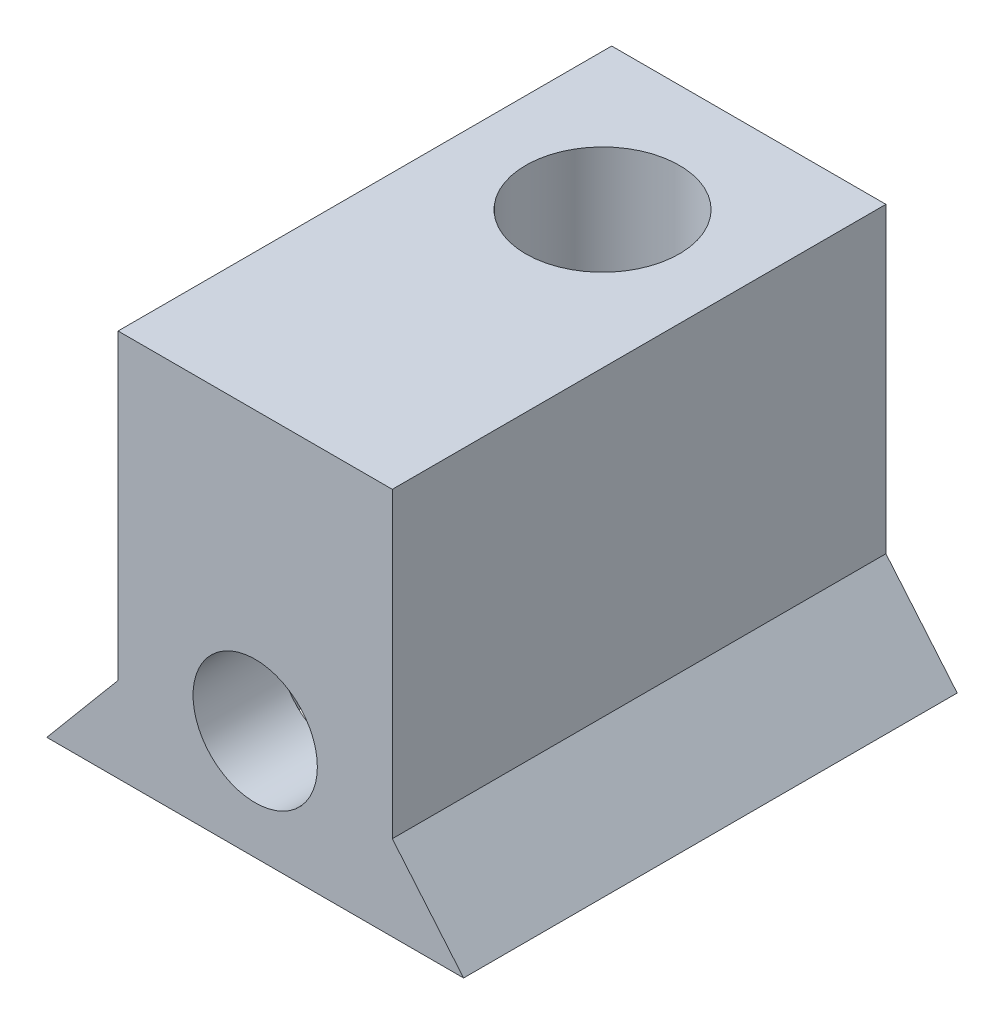
ISO-10303-21;
HEADER;
FILE_DESCRIPTION(('STEP AP214'),'2;1');
FILE_NAME('part.step','',(''),(''),'','','');
FILE_SCHEMA(('AUTOMOTIVE_DESIGN { 1 0 10303 214 1 1 1 1 }'));
ENDSEC;
DATA;
#1=APPLICATION_CONTEXT('core data for automotive mechanical design processes');
#2=APPLICATION_PROTOCOL_DEFINITION('international standard','automotive_design',2000,#1);
#3=PRODUCT_CONTEXT('',#1,'mechanical');
#4=PRODUCT('Part','Part','',(#3));
#5=PRODUCT_RELATED_PRODUCT_CATEGORY('part','',(#4));
#6=PRODUCT_DEFINITION_FORMATION('','',#4);
#7=PRODUCT_DEFINITION_CONTEXT('part definition',#1,'design');
#8=PRODUCT_DEFINITION('design','',#6,#7);
#9=PRODUCT_DEFINITION_SHAPE('','',#8);
#10=(LENGTH_UNIT() NAMED_UNIT(*) SI_UNIT(.MILLI.,.METRE.));
#11=(NAMED_UNIT(*) PLANE_ANGLE_UNIT() SI_UNIT($,.RADIAN.));
#12=(NAMED_UNIT(*) SI_UNIT($,.STERADIAN.) SOLID_ANGLE_UNIT());
#13=UNCERTAINTY_MEASURE_WITH_UNIT(LENGTH_MEASURE(1.E-05),#10,'distance_accuracy_value','');
#14=(GEOMETRIC_REPRESENTATION_CONTEXT(3) GLOBAL_UNCERTAINTY_ASSIGNED_CONTEXT((#13)) GLOBAL_UNIT_ASSIGNED_CONTEXT((#10,
#11,#12)) REPRESENTATION_CONTEXT('',''));
#15=CARTESIAN_POINT('',(0.,0.,0.));
#16=DIRECTION('',(0.,0.,1.));
#17=DIRECTION('',(1.,0.,0.));
#18=AXIS2_PLACEMENT_3D('',#15,#16,#17);
#19=CARTESIAN_POINT('',(0.,3.,13.5));
#20=DIRECTION('',(0.,0.,-1.));
#21=DIRECTION('',(-1.,0.,0.));
#22=AXIS2_PLACEMENT_3D('',#19,#20,#21);
#23=CYLINDRICAL_SURFACE('',#22,1.7);
#24=CARTESIAN_POINT('',(0.,3.,0.));
#25=DIRECTION('',(0.,0.,1.));
#26=DIRECTION('',(1.,0.,0.));
#27=AXIS2_PLACEMENT_3D('',#24,#25,#26);
#28=CIRCLE('',#27,1.7);
#29=CARTESIAN_POINT('',(1.7,3.,0.));
#30=VERTEX_POINT('',#29);
#31=EDGE_CURVE('E229',#30,#30,#28,.T.);
#32=ORIENTED_EDGE('',*,*,#31,.F.);
#33=EDGE_LOOP('',(#32));
#34=FACE_BOUND('',#33,.T.);
#35=CARTESIAN_POINT('',(0.,3.,8.15));
#36=DIRECTION('',(0.,0.,1.));
#37=DIRECTION('',(1.,0.,0.));
#38=AXIS2_PLACEMENT_3D('',#35,#36,#37);
#39=CIRCLE('',#38,1.7);
#40=CARTESIAN_POINT('',(1.7,3.,8.15));
#41=VERTEX_POINT('',#40);
#42=EDGE_CURVE('E173',#41,#41,#39,.T.);
#43=ORIENTED_EDGE('',*,*,#42,.T.);
#44=EDGE_LOOP('',(#43));
#45=FACE_BOUND('',#44,.T.);
#46=ADVANCED_FACE('F39',(#34,#45),#23,.F.);
#47=CARTESIAN_POINT('',(0.,0.,13.5));
#48=DIRECTION('',(0.,0.,-1.));
#49=DIRECTION('',(-1.,0.,0.));
#50=AXIS2_PLACEMENT_3D('',#47,#48,#49);
#51=PLANE('',#50);
#52=DIRECTION('',(-0.642787609686543,0.766044443118974,0.));
#53=VECTOR('',#52,1.);
#54=CARTESIAN_POINT('',(5.7,0.,13.5));
#55=LINE('',#54,#53);
#56=CARTESIAN_POINT('',(5.7,0.,13.5));
#57=VERTEX_POINT('',#56);
#58=CARTESIAN_POINT('',(3.75,2.32391950555868,13.5));
#59=VERTEX_POINT('',#58);
#60=EDGE_CURVE('E159',#57,#59,#55,.T.);
#61=ORIENTED_EDGE('',*,*,#60,.T.);
#62=DIRECTION('',(0.,1.,0.));
#63=VECTOR('',#62,1.);
#64=CARTESIAN_POINT('',(3.75,2.32391950555868,13.5));
#65=LINE('',#64,#63);
#66=CARTESIAN_POINT('',(3.75,10.6,13.5));
#67=VERTEX_POINT('',#66);
#68=EDGE_CURVE('E99',#59,#67,#65,.T.);
#69=ORIENTED_EDGE('',*,*,#68,.T.);
#70=DIRECTION('',(-1.,0.,0.));
#71=VECTOR('',#70,1.);
#72=CARTESIAN_POINT('',(3.75,10.6,13.5));
#73=LINE('',#72,#71);
#74=CARTESIAN_POINT('',(-3.75000000000002,10.6,13.5));
#75=VERTEX_POINT('',#74);
#76=EDGE_CURVE('E116',#67,#75,#73,.T.);
#77=ORIENTED_EDGE('',*,*,#76,.T.);
#78=DIRECTION('',(0.,-1.,0.));
#79=VECTOR('',#78,1.);
#80=CARTESIAN_POINT('',(-3.75000000000002,2.32391950555868,13.5));
#81=LINE('',#80,#79);
#82=CARTESIAN_POINT('',(-3.75000000000002,2.32391950555868,13.5));
#83=VERTEX_POINT('',#82);
#84=EDGE_CURVE('E108',#75,#83,#81,.T.);
#85=ORIENTED_EDGE('',*,*,#84,.T.);
#86=DIRECTION('',(-0.642787609686544,-0.766044443118974,0.));
#87=VECTOR('',#86,1.);
#88=CARTESIAN_POINT('',(-5.70000000000002,0.,13.5));
#89=LINE('',#88,#87);
#90=CARTESIAN_POINT('',(-5.70000000000002,0.,13.5));
#91=VERTEX_POINT('',#90);
#92=EDGE_CURVE('E113',#83,#91,#89,.T.);
#93=ORIENTED_EDGE('',*,*,#92,.T.);
#94=DIRECTION('',(1.,0.,0.));
#95=VECTOR('',#94,1.);
#96=CARTESIAN_POINT('',(-5.70000000000002,0.,13.5));
#97=LINE('',#96,#95);
#98=EDGE_CURVE('E63',#91,#57,#97,.T.);
#99=ORIENTED_EDGE('',*,*,#98,.T.);
#100=EDGE_LOOP('',(#61,#69,#77,#85,#93,#99));
#101=FACE_BOUND('',#100,.T.);
#102=CARTESIAN_POINT('',(0.,3.,13.5));
#103=DIRECTION('',(0.,0.,1.));
#104=DIRECTION('',(1.,0.,0.));
#105=AXIS2_PLACEMENT_3D('',#102,#103,#104);
#106=CIRCLE('',#105,1.7);
#107=CARTESIAN_POINT('',(1.7,3.,13.5));
#108=VERTEX_POINT('',#107);
#109=EDGE_CURVE('E146',#108,#108,#106,.T.);
#110=ORIENTED_EDGE('',*,*,#109,.F.);
#111=EDGE_LOOP('',(#110));
#112=FACE_BOUND('',#111,.T.);
#113=ADVANCED_FACE('F110',(#101,#112),#51,.F.);
#114=CARTESIAN_POINT('',(0.,0.,0.));
#115=DIRECTION('',(0.,0.,-1.));
#116=DIRECTION('',(-1.,0.,0.));
#117=AXIS2_PLACEMENT_3D('',#114,#115,#116);
#118=PLANE('',#117);
#119=DIRECTION('',(-0.642787609686543,0.766044443118974,0.));
#120=VECTOR('',#119,1.);
#121=CARTESIAN_POINT('',(5.7,0.,0.));
#122=LINE('',#121,#120);
#123=CARTESIAN_POINT('',(5.7,0.,0.));
#124=VERTEX_POINT('',#123);
#125=CARTESIAN_POINT('',(3.75,2.32391950555868,0.));
#126=VERTEX_POINT('',#125);
#127=EDGE_CURVE('E141',#124,#126,#122,.T.);
#128=ORIENTED_EDGE('',*,*,#127,.F.);
#129=DIRECTION('',(1.,0.,0.));
#130=VECTOR('',#129,1.);
#131=CARTESIAN_POINT('',(-5.70000000000002,0.,0.));
#132=LINE('',#131,#130);
#133=CARTESIAN_POINT('',(-5.70000000000002,0.,0.));
#134=VERTEX_POINT('',#133);
#135=EDGE_CURVE('E90',#134,#124,#132,.T.);
#136=ORIENTED_EDGE('',*,*,#135,.F.);
#137=DIRECTION('',(-0.642787609686544,-0.766044443118974,0.));
#138=VECTOR('',#137,1.);
#139=CARTESIAN_POINT('',(-5.70000000000002,0.,0.));
#140=LINE('',#139,#138);
#141=CARTESIAN_POINT('',(-3.75000000000002,2.32391950555868,0.));
#142=VERTEX_POINT('',#141);
#143=EDGE_CURVE('E154',#142,#134,#140,.T.);
#144=ORIENTED_EDGE('',*,*,#143,.F.);
#145=DIRECTION('',(0.,-1.,0.));
#146=VECTOR('',#145,1.);
#147=CARTESIAN_POINT('',(-3.75000000000002,2.32391950555868,0.));
#148=LINE('',#147,#146);
#149=CARTESIAN_POINT('',(-3.75000000000002,10.6,0.));
#150=VERTEX_POINT('',#149);
#151=EDGE_CURVE('E126',#150,#142,#148,.T.);
#152=ORIENTED_EDGE('',*,*,#151,.F.);
#153=DIRECTION('',(-1.,0.,0.));
#154=VECTOR('',#153,1.);
#155=CARTESIAN_POINT('',(3.75,10.6,0.));
#156=LINE('',#155,#154);
#157=CARTESIAN_POINT('',(3.75,10.6,0.));
#158=VERTEX_POINT('',#157);
#159=EDGE_CURVE('E149',#158,#150,#156,.T.);
#160=ORIENTED_EDGE('',*,*,#159,.F.);
#161=DIRECTION('',(0.,1.,0.));
#162=VECTOR('',#161,1.);
#163=CARTESIAN_POINT('',(3.75,2.32391950555868,0.));
#164=LINE('',#163,#162);
#165=EDGE_CURVE('E145',#126,#158,#164,.T.);
#166=ORIENTED_EDGE('',*,*,#165,.F.);
#167=EDGE_LOOP('',(#128,#136,#144,#152,#160,#166));
#168=FACE_BOUND('',#167,.T.);
#169=ORIENTED_EDGE('',*,*,#31,.T.);
#170=EDGE_LOOP('',(#169));
#171=FACE_BOUND('',#170,.T.);
#172=ADVANCED_FACE('F249',(#168,#171),#118,.T.);
#173=CARTESIAN_POINT('',(5.7,0.,13.5));
#174=DIRECTION('',(-0.766044443118974,-0.642787609686544,0.));
#175=DIRECTION('',(0.642787609686544,-0.766044443118974,0.));
#176=AXIS2_PLACEMENT_3D('',#173,#174,#175);
#177=PLANE('',#176);
#178=ORIENTED_EDGE('',*,*,#127,.T.);
#179=DIRECTION('',(0.,0.,-1.));
#180=VECTOR('',#179,1.);
#181=CARTESIAN_POINT('',(3.75,2.32391950555868,13.5));
#182=LINE('',#181,#180);
#183=EDGE_CURVE('E170',#59,#126,#182,.T.);
#184=ORIENTED_EDGE('',*,*,#183,.F.);
#185=ORIENTED_EDGE('',*,*,#60,.F.);
#186=DIRECTION('',(0.,0.,-1.));
#187=VECTOR('',#186,1.);
#188=CARTESIAN_POINT('',(5.7,0.,13.5));
#189=LINE('',#188,#187);
#190=EDGE_CURVE('E137',#57,#124,#189,.T.);
#191=ORIENTED_EDGE('',*,*,#190,.T.);
#192=EDGE_LOOP('',(#178,#184,#185,#191));
#193=FACE_BOUND('',#192,.T.);
#194=ADVANCED_FACE('F41',(#193),#177,.F.);
#195=CARTESIAN_POINT('',(3.75,2.32391950555868,13.5));
#196=DIRECTION('',(-1.,0.,0.));
#197=DIRECTION('',(0.,0.,1.));
#198=AXIS2_PLACEMENT_3D('',#195,#196,#197);
#199=PLANE('',#198);
#200=ORIENTED_EDGE('',*,*,#165,.T.);
#201=DIRECTION('',(0.,0.,-1.));
#202=VECTOR('',#201,1.);
#203=CARTESIAN_POINT('',(3.75,10.6,13.5));
#204=LINE('',#203,#202);
#205=EDGE_CURVE('E166',#67,#158,#204,.T.);
#206=ORIENTED_EDGE('',*,*,#205,.F.);
#207=ORIENTED_EDGE('',*,*,#68,.F.);
#208=ORIENTED_EDGE('',*,*,#183,.T.);
#209=EDGE_LOOP('',(#200,#206,#207,#208));
#210=FACE_BOUND('',#209,.T.);
#211=ADVANCED_FACE('F243',(#210),#199,.F.);
#212=CARTESIAN_POINT('',(3.75,10.6,13.5));
#213=DIRECTION('',(0.,-1.,0.));
#214=DIRECTION('',(0.,0.,-1.));
#215=AXIS2_PLACEMENT_3D('',#212,#213,#214);
#216=PLANE('',#215);
#217=CARTESIAN_POINT('',(0.,10.6,4.));
#218=DIRECTION('',(0.,1.,0.));
#219=DIRECTION('',(0.,0.,1.));
#220=AXIS2_PLACEMENT_3D('',#217,#218,#219);
#221=CIRCLE('',#220,2.1);
#222=CARTESIAN_POINT('',(0.,10.6,6.1));
#223=VERTEX_POINT('',#222);
#224=EDGE_CURVE('E218',#223,#223,#221,.T.);
#225=ORIENTED_EDGE('',*,*,#224,.F.);
#226=EDGE_LOOP('',(#225));
#227=FACE_BOUND('',#226,.T.);
#228=ORIENTED_EDGE('',*,*,#159,.T.);
#229=DIRECTION('',(0.,0.,-1.));
#230=VECTOR('',#229,1.);
#231=CARTESIAN_POINT('',(-3.75000000000002,10.6,13.5));
#232=LINE('',#231,#230);
#233=EDGE_CURVE('E130',#75,#150,#232,.T.);
#234=ORIENTED_EDGE('',*,*,#233,.F.);
#235=ORIENTED_EDGE('',*,*,#76,.F.);
#236=ORIENTED_EDGE('',*,*,#205,.T.);
#237=EDGE_LOOP('',(#228,#234,#235,#236));
#238=FACE_BOUND('',#237,.T.);
#239=ADVANCED_FACE('F246',(#227,#238),#216,.F.);
#240=CARTESIAN_POINT('',(-3.75000000000002,2.32391950555868,13.5));
#241=DIRECTION('',(1.,0.,0.));
#242=DIRECTION('',(0.,1.,0.));
#243=AXIS2_PLACEMENT_3D('',#240,#241,#242);
#244=PLANE('',#243);
#245=ORIENTED_EDGE('',*,*,#151,.T.);
#246=DIRECTION('',(0.,0.,-1.));
#247=VECTOR('',#246,1.);
#248=CARTESIAN_POINT('',(-3.75000000000002,2.32391950555868,13.5));
#249=LINE('',#248,#247);
#250=EDGE_CURVE('E123',#83,#142,#249,.T.);
#251=ORIENTED_EDGE('',*,*,#250,.F.);
#252=ORIENTED_EDGE('',*,*,#84,.F.);
#253=ORIENTED_EDGE('',*,*,#233,.T.);
#254=EDGE_LOOP('',(#245,#251,#252,#253));
#255=FACE_BOUND('',#254,.T.);
#256=ADVANCED_FACE('F124',(#255),#244,.F.);
#257=CARTESIAN_POINT('',(-5.70000000000002,0.,13.5));
#258=DIRECTION('',(0.766044443118974,-0.642787609686544,0.));
#259=DIRECTION('',(0.642787609686544,0.766044443118974,0.));
#260=AXIS2_PLACEMENT_3D('',#257,#258,#259);
#261=PLANE('',#260);
#262=ORIENTED_EDGE('',*,*,#143,.T.);
#263=DIRECTION('',(0.,0.,-1.));
#264=VECTOR('',#263,1.);
#265=CARTESIAN_POINT('',(-5.70000000000002,0.,13.5));
#266=LINE('',#265,#264);
#267=EDGE_CURVE('E131',#91,#134,#266,.T.);
#268=ORIENTED_EDGE('',*,*,#267,.F.);
#269=ORIENTED_EDGE('',*,*,#92,.F.);
#270=ORIENTED_EDGE('',*,*,#250,.T.);
#271=EDGE_LOOP('',(#262,#268,#269,#270));
#272=FACE_BOUND('',#271,.T.);
#273=ADVANCED_FACE('F133',(#272),#261,.F.);
#274=CARTESIAN_POINT('',(-5.70000000000002,0.,13.5));
#275=DIRECTION('',(0.,1.,0.));
#276=DIRECTION('',(0.,0.,1.));
#277=AXIS2_PLACEMENT_3D('',#274,#275,#276);
#278=PLANE('',#277);
#279=DIRECTION('',(0.,0.,-1.));
#280=VECTOR('',#279,1.);
#281=CARTESIAN_POINT('',(-2.90118510267787,0.,13.5));
#282=LINE('',#281,#280);
#283=CARTESIAN_POINT('',(-2.90118510267787,0.,11.15));
#284=VERTEX_POINT('',#283);
#285=CARTESIAN_POINT('',(-2.90118510267787,0.,8.15));
#286=VERTEX_POINT('',#285);
#287=EDGE_CURVE('E11',#284,#286,#282,.T.);
#288=ORIENTED_EDGE('',*,*,#287,.F.);
#289=DIRECTION('',(1.,0.,0.));
#290=VECTOR('',#289,1.);
#291=CARTESIAN_POINT('',(-5.70000000000002,0.,11.15));
#292=LINE('',#291,#290);
#293=CARTESIAN_POINT('',(2.90118510267787,0.,11.15));
#294=VERTEX_POINT('',#293);
#295=EDGE_CURVE('E182',#284,#294,#292,.T.);
#296=ORIENTED_EDGE('',*,*,#295,.T.);
#297=DIRECTION('',(0.,0.,1.));
#298=VECTOR('',#297,1.);
#299=CARTESIAN_POINT('',(2.90118510267787,0.,13.5));
#300=LINE('',#299,#298);
#301=CARTESIAN_POINT('',(2.90118510267787,0.,8.15));
#302=VERTEX_POINT('',#301);
#303=EDGE_CURVE('E48',#302,#294,#300,.T.);
#304=ORIENTED_EDGE('',*,*,#303,.F.);
#305=DIRECTION('',(1.,0.,0.));
#306=VECTOR('',#305,1.);
#307=CARTESIAN_POINT('',(-5.70000000000002,0.,8.15));
#308=LINE('',#307,#306);
#309=EDGE_CURVE('E177',#286,#302,#308,.T.);
#310=ORIENTED_EDGE('',*,*,#309,.F.);
#311=EDGE_LOOP('',(#288,#296,#304,#310));
#312=FACE_BOUND('',#311,.T.);
#313=ORIENTED_EDGE('',*,*,#135,.T.);
#314=ORIENTED_EDGE('',*,*,#190,.F.);
#315=ORIENTED_EDGE('',*,*,#98,.F.);
#316=ORIENTED_EDGE('',*,*,#267,.T.);
#317=EDGE_LOOP('',(#313,#314,#315,#316));
#318=FACE_BOUND('',#317,.T.);
#319=ADVANCED_FACE('F216',(#312,#318),#278,.F.);
#320=CARTESIAN_POINT('',(0.,3.,11.15));
#321=DIRECTION('',(0.,0.,1.));
#322=DIRECTION('',(1.,0.,0.));
#323=AXIS2_PLACEMENT_3D('',#320,#321,#322);
#324=CIRCLE('',#323,1.7);
#325=CARTESIAN_POINT('',(1.7,3.,11.15));
#326=VERTEX_POINT('',#325);
#327=EDGE_CURVE('E179',#326,#326,#324,.T.);
#328=ORIENTED_EDGE('',*,*,#327,.F.);
#329=EDGE_LOOP('',(#328));
#330=FACE_BOUND('',#329,.T.);
#331=ORIENTED_EDGE('',*,*,#109,.T.);
#332=EDGE_LOOP('',(#331));
#333=FACE_BOUND('',#332,.T.);
#334=ADVANCED_FACE('F261',(#330,#333),#23,.F.);
#335=CARTESIAN_POINT('',(0.,5.5,4.));
#336=DIRECTION('',(0.,1.,0.));
#337=DIRECTION('',(0.,0.,1.));
#338=AXIS2_PLACEMENT_3D('',#335,#336,#337);
#339=CYLINDRICAL_SURFACE('',#338,2.1);
#340=CARTESIAN_POINT('',(0.,5.5,4.));
#341=DIRECTION('',(0.,1.,0.));
#342=DIRECTION('',(0.,0.,1.));
#343=AXIS2_PLACEMENT_3D('',#340,#341,#342);
#344=CIRCLE('',#343,2.1);
#345=CARTESIAN_POINT('',(0.,5.5,6.1));
#346=VERTEX_POINT('',#345);
#347=EDGE_CURVE('E222',#346,#346,#344,.T.);
#348=ORIENTED_EDGE('',*,*,#347,.F.);
#349=EDGE_LOOP('',(#348));
#350=FACE_BOUND('',#349,.T.);
#351=ORIENTED_EDGE('',*,*,#224,.T.);
#352=EDGE_LOOP('',(#351));
#353=FACE_BOUND('',#352,.T.);
#354=ADVANCED_FACE('F270',(#350,#353),#339,.F.);
#355=CARTESIAN_POINT('',(0.,5.5,4.));
#356=DIRECTION('',(0.,1.,0.));
#357=DIRECTION('',(0.,0.,1.));
#358=AXIS2_PLACEMENT_3D('',#355,#356,#357);
#359=PLANE('',#358);
#360=ORIENTED_EDGE('',*,*,#347,.T.);
#361=EDGE_LOOP('',(#360));
#362=FACE_BOUND('',#361,.T.);
#363=ADVANCED_FACE('F276',(#362),#359,.T.);
#364=CARTESIAN_POINT('',(-2.90118510267787,1.325,11.15));
#365=DIRECTION('',(1.,0.,0.));
#366=DIRECTION('',(0.,1.,0.));
#367=AXIS2_PLACEMENT_3D('',#364,#365,#366);
#368=PLANE('',#367);
#369=ORIENTED_EDGE('',*,*,#287,.T.);
#370=DIRECTION('',(0.,-1.,0.));
#371=VECTOR('',#370,1.);
#372=CARTESIAN_POINT('',(-2.90118510267787,4.675,8.15));
#373=LINE('',#372,#371);
#374=CARTESIAN_POINT('',(-2.90118510267787,4.675,8.15));
#375=VERTEX_POINT('',#374);
#376=EDGE_CURVE('E55',#375,#286,#373,.T.);
#377=ORIENTED_EDGE('',*,*,#376,.F.);
#378=DIRECTION('',(0.,0.,-1.));
#379=VECTOR('',#378,1.);
#380=CARTESIAN_POINT('',(-2.90118510267787,4.675,11.15));
#381=LINE('',#380,#379);
#382=CARTESIAN_POINT('',(-2.90118510267787,4.675,11.15));
#383=VERTEX_POINT('',#382);
#384=EDGE_CURVE('E434',#383,#375,#381,.T.);
#385=ORIENTED_EDGE('',*,*,#384,.F.);
#386=DIRECTION('',(0.,-1.,0.));
#387=VECTOR('',#386,1.);
#388=CARTESIAN_POINT('',(-2.90118510267787,4.675,11.15));
#389=LINE('',#388,#387);
#390=EDGE_CURVE('E213',#383,#284,#389,.T.);
#391=ORIENTED_EDGE('',*,*,#390,.T.);
#392=EDGE_LOOP('',(#369,#377,#385,#391));
#393=FACE_BOUND('',#392,.T.);
#394=ADVANCED_FACE('F293',(#393),#368,.T.);
#395=CARTESIAN_POINT('',(2.90118510267787,1.325,11.15));
#396=DIRECTION('',(-1.,0.,0.));
#397=DIRECTION('',(0.,0.,1.));
#398=AXIS2_PLACEMENT_3D('',#395,#396,#397);
#399=PLANE('',#398);
#400=ORIENTED_EDGE('',*,*,#303,.T.);
#401=DIRECTION('',(0.,1.,0.));
#402=VECTOR('',#401,1.);
#403=CARTESIAN_POINT('',(2.90118510267787,-5.325,11.15));
#404=LINE('',#403,#402);
#405=CARTESIAN_POINT('',(2.90118510267787,4.675,11.15));
#406=VERTEX_POINT('',#405);
#407=EDGE_CURVE('E193',#294,#406,#404,.T.);
#408=ORIENTED_EDGE('',*,*,#407,.T.);
#409=DIRECTION('',(0.,0.,-1.));
#410=VECTOR('',#409,1.);
#411=CARTESIAN_POINT('',(2.90118510267787,4.675,11.15));
#412=LINE('',#411,#410);
#413=CARTESIAN_POINT('',(2.90118510267787,4.675,8.15));
#414=VERTEX_POINT('',#413);
#415=EDGE_CURVE('E212',#406,#414,#412,.T.);
#416=ORIENTED_EDGE('',*,*,#415,.T.);
#417=DIRECTION('',(0.,1.,0.));
#418=VECTOR('',#417,1.);
#419=CARTESIAN_POINT('',(2.90118510267787,-5.325,8.15));
#420=LINE('',#419,#418);
#421=EDGE_CURVE('E197',#302,#414,#420,.T.);
#422=ORIENTED_EDGE('',*,*,#421,.F.);
#423=EDGE_LOOP('',(#400,#408,#416,#422));
#424=FACE_BOUND('',#423,.T.);
#425=ADVANCED_FACE('F190',(#424),#399,.T.);
#426=CARTESIAN_POINT('',(0.,0.,11.15));
#427=DIRECTION('',(0.,0.,1.));
#428=DIRECTION('',(1.,0.,0.));
#429=AXIS2_PLACEMENT_3D('',#426,#427,#428);
#430=PLANE('',#429);
#431=ORIENTED_EDGE('',*,*,#327,.T.);
#432=EDGE_LOOP('',(#431));
#433=FACE_BOUND('',#432,.T.);
#434=ORIENTED_EDGE('',*,*,#390,.F.);
#435=DIRECTION('',(-0.866025403784439,-0.5,0.));
#436=VECTOR('',#435,1.);
#437=CARTESIAN_POINT('',(0.,6.35,11.15));
#438=LINE('',#437,#436);
#439=CARTESIAN_POINT('',(0.,6.35,11.15));
#440=VERTEX_POINT('',#439);
#441=EDGE_CURVE('E459',#440,#383,#438,.T.);
#442=ORIENTED_EDGE('',*,*,#441,.F.);
#443=DIRECTION('',(-0.866025403784439,0.5,0.));
#444=VECTOR('',#443,1.);
#445=CARTESIAN_POINT('',(2.90118510267787,4.675,11.15));
#446=LINE('',#445,#444);
#447=EDGE_CURVE('E210',#406,#440,#446,.T.);
#448=ORIENTED_EDGE('',*,*,#447,.F.);
#449=ORIENTED_EDGE('',*,*,#407,.F.);
#450=ORIENTED_EDGE('',*,*,#295,.F.);
#451=EDGE_LOOP('',(#434,#442,#448,#449,#450));
#452=FACE_BOUND('',#451,.T.);
#453=ADVANCED_FACE('F206',(#433,#452),#430,.F.);
#454=CARTESIAN_POINT('',(0.,0.,8.15));
#455=DIRECTION('',(0.,0.,1.));
#456=DIRECTION('',(1.,0.,0.));
#457=AXIS2_PLACEMENT_3D('',#454,#455,#456);
#458=PLANE('',#457);
#459=ORIENTED_EDGE('',*,*,#42,.F.);
#460=EDGE_LOOP('',(#459));
#461=FACE_BOUND('',#460,.T.);
#462=ORIENTED_EDGE('',*,*,#309,.T.);
#463=ORIENTED_EDGE('',*,*,#421,.T.);
#464=DIRECTION('',(-0.866025403784439,0.5,0.));
#465=VECTOR('',#464,1.);
#466=CARTESIAN_POINT('',(2.90118510267787,4.675,8.15));
#467=LINE('',#466,#465);
#468=CARTESIAN_POINT('',(0.,6.35,8.15));
#469=VERTEX_POINT('',#468);
#470=EDGE_CURVE('E430',#414,#469,#467,.T.);
#471=ORIENTED_EDGE('',*,*,#470,.T.);
#472=DIRECTION('',(-0.866025403784439,-0.5,0.));
#473=VECTOR('',#472,1.);
#474=CARTESIAN_POINT('',(0.,6.35,8.15));
#475=LINE('',#474,#473);
#476=EDGE_CURVE('E446',#469,#375,#475,.T.);
#477=ORIENTED_EDGE('',*,*,#476,.T.);
#478=ORIENTED_EDGE('',*,*,#376,.T.);
#479=EDGE_LOOP('',(#462,#463,#471,#477,#478));
#480=FACE_BOUND('',#479,.T.);
#481=ADVANCED_FACE('F284',(#461,#480),#458,.T.);
#482=CARTESIAN_POINT('',(2.90118510267787,4.675,11.15));
#483=DIRECTION('',(-0.5,-0.866025403784439,0.));
#484=DIRECTION('',(0.866025403784439,-0.5,0.));
#485=AXIS2_PLACEMENT_3D('',#482,#483,#484);
#486=PLANE('',#485);
#487=ORIENTED_EDGE('',*,*,#415,.F.);
#488=ORIENTED_EDGE('',*,*,#447,.T.);
#489=DIRECTION('',(0.,0.,-1.));
#490=VECTOR('',#489,1.);
#491=CARTESIAN_POINT('',(0.,6.35,11.15));
#492=LINE('',#491,#490);
#493=EDGE_CURVE('E178',#440,#469,#492,.T.);
#494=ORIENTED_EDGE('',*,*,#493,.T.);
#495=ORIENTED_EDGE('',*,*,#470,.F.);
#496=EDGE_LOOP('',(#487,#488,#494,#495));
#497=FACE_BOUND('',#496,.T.);
#498=ADVANCED_FACE('F290',(#497),#486,.T.);
#499=CARTESIAN_POINT('',(0.,6.35,11.15));
#500=DIRECTION('',(0.5,-0.866025403784439,0.));
#501=DIRECTION('',(0.866025403784439,0.5,0.));
#502=AXIS2_PLACEMENT_3D('',#499,#500,#501);
#503=PLANE('',#502);
#504=ORIENTED_EDGE('',*,*,#493,.F.);
#505=ORIENTED_EDGE('',*,*,#441,.T.);
#506=ORIENTED_EDGE('',*,*,#384,.T.);
#507=ORIENTED_EDGE('',*,*,#476,.F.);
#508=EDGE_LOOP('',(#504,#505,#506,#507));
#509=FACE_BOUND('',#508,.T.);
#510=ADVANCED_FACE('F299',(#509),#503,.T.);
#511=CLOSED_SHELL('',(#46,#113,#172,#194,#211,#239,#256,#273,#319,#334,#354,#363,#394,#425,#453,
#481,#498,#510));
#512=MANIFOLD_SOLID_BREP('B2',#511);
#513=ADVANCED_BREP_SHAPE_REPRESENTATION('',(#18,#512),#14);
#514=SHAPE_DEFINITION_REPRESENTATION(#9,#513);
ENDSEC;
END-ISO-10303-21;
